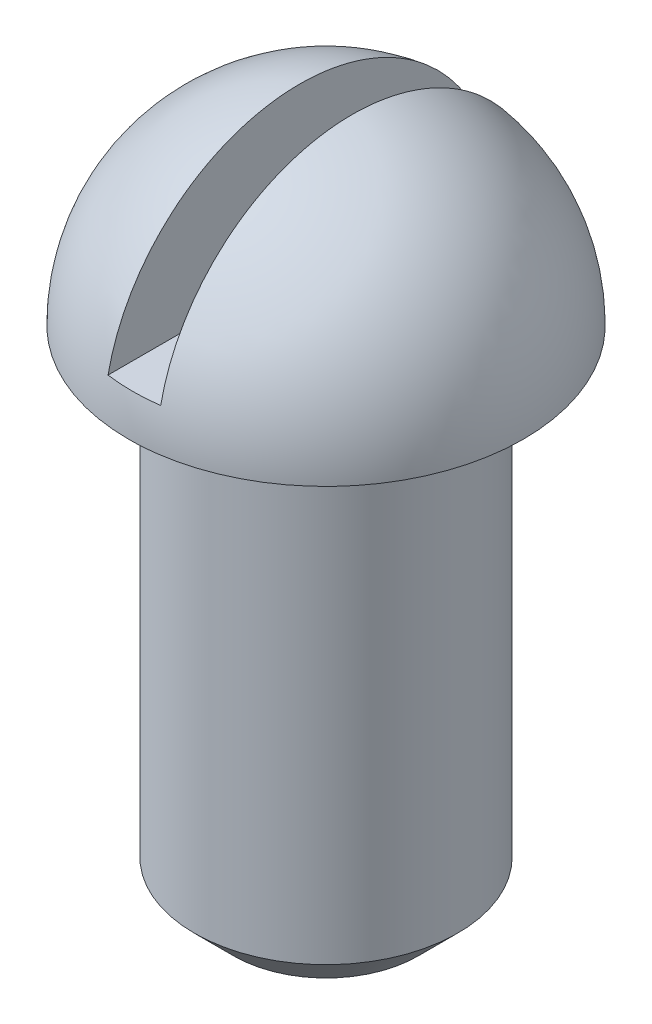
ISO-10303-21;
HEADER;
FILE_DESCRIPTION(('STEP AP214'),'2;1');
FILE_NAME('part.step','',(''),(''),'','','');
FILE_SCHEMA(('AUTOMOTIVE_DESIGN { 1 0 10303 214 1 1 1 1 }'));
ENDSEC;
DATA;
#1=APPLICATION_CONTEXT('core data for automotive mechanical design processes');
#2=APPLICATION_PROTOCOL_DEFINITION('international standard','automotive_design',2000,#1);
#3=PRODUCT_CONTEXT('',#1,'mechanical');
#4=PRODUCT('Part','Part','',(#3));
#5=PRODUCT_RELATED_PRODUCT_CATEGORY('part','',(#4));
#6=PRODUCT_DEFINITION_FORMATION('','',#4);
#7=PRODUCT_DEFINITION_CONTEXT('part definition',#1,'design');
#8=PRODUCT_DEFINITION('design','',#6,#7);
#9=PRODUCT_DEFINITION_SHAPE('','',#8);
#10=(LENGTH_UNIT() NAMED_UNIT(*) SI_UNIT(.MILLI.,.METRE.));
#11=(NAMED_UNIT(*) PLANE_ANGLE_UNIT() SI_UNIT($,.RADIAN.));
#12=(NAMED_UNIT(*) SI_UNIT($,.STERADIAN.) SOLID_ANGLE_UNIT());
#13=UNCERTAINTY_MEASURE_WITH_UNIT(LENGTH_MEASURE(1.E-05),#10,'distance_accuracy_value','');
#14=(GEOMETRIC_REPRESENTATION_CONTEXT(3) GLOBAL_UNCERTAINTY_ASSIGNED_CONTEXT((#13)) GLOBAL_UNIT_ASSIGNED_CONTEXT((#10,
#11,#12)) REPRESENTATION_CONTEXT('',''));
#15=CARTESIAN_POINT('',(0.,0.,0.));
#16=DIRECTION('',(0.,0.,1.));
#17=DIRECTION('',(1.,0.,0.));
#18=AXIS2_PLACEMENT_3D('',#15,#16,#17);
#19=CARTESIAN_POINT('',(0.,38.,0.));
#20=DIRECTION('',(0.,-1.,0.));
#21=DIRECTION('',(0.,0.,-1.));
#22=AXIS2_PLACEMENT_3D('',#19,#20,#21);
#23=CYLINDRICAL_SURFACE('',#22,10.);
#24=CARTESIAN_POINT('',(0.,3.,0.));
#25=DIRECTION('',(0.,1.,0.));
#26=DIRECTION('',(0.,0.,1.));
#27=AXIS2_PLACEMENT_3D('',#24,#25,#26);
#28=CIRCLE('',#27,10.);
#29=CARTESIAN_POINT('',(0.,3.,10.));
#30=VERTEX_POINT('',#29);
#31=EDGE_CURVE('E41',#30,#30,#28,.T.);
#32=ORIENTED_EDGE('',*,*,#31,.T.);
#33=EDGE_LOOP('',(#32));
#34=FACE_BOUND('',#33,.T.);
#35=CARTESIAN_POINT('',(0.,38.,0.));
#36=DIRECTION('',(0.,1.,0.));
#37=DIRECTION('',(0.,0.,1.));
#38=AXIS2_PLACEMENT_3D('',#35,#36,#37);
#39=CIRCLE('',#38,10.);
#40=CARTESIAN_POINT('',(0.,38.,10.));
#41=VERTEX_POINT('',#40);
#42=EDGE_CURVE('E78',#41,#41,#39,.T.);
#43=ORIENTED_EDGE('',*,*,#42,.F.);
#44=EDGE_LOOP('',(#43));
#45=FACE_BOUND('',#44,.T.);
#46=ADVANCED_FACE('F33',(#34,#45),#23,.T.);
#47=CARTESIAN_POINT('',(0.,0.,0.));
#48=DIRECTION('',(0.,1.,0.));
#49=DIRECTION('',(0.,0.,1.));
#50=AXIS2_PLACEMENT_3D('',#47,#48,#49);
#51=PLANE('',#50);
#52=CARTESIAN_POINT('',(0.,0.,0.));
#53=DIRECTION('',(0.,1.,0.));
#54=DIRECTION('',(0.,0.,1.));
#55=AXIS2_PLACEMENT_3D('',#52,#53,#54);
#56=CIRCLE('',#55,6.99999999999999);
#57=CARTESIAN_POINT('',(0.,0.,6.99999999999999));
#58=VERTEX_POINT('',#57);
#59=EDGE_CURVE('E11',#58,#58,#56,.F.);
#60=ORIENTED_EDGE('',*,*,#59,.T.);
#61=EDGE_LOOP('',(#60));
#62=FACE_BOUND('',#61,.T.);
#63=ADVANCED_FACE('F93',(#62),#51,.F.);
#64=CARTESIAN_POINT('',(0.,38.,0.));
#65=DIRECTION('',(0.,-1.,0.));
#66=DIRECTION('',(0.,0.,-1.));
#67=AXIS2_PLACEMENT_3D('',#64,#65,#66);
#68=PLANE('',#67);
#69=CARTESIAN_POINT('',(0.,38.,0.));
#70=DIRECTION('',(0.,1.,0.));
#71=DIRECTION('',(0.,0.,1.));
#72=AXIS2_PLACEMENT_3D('',#69,#70,#71);
#73=CIRCLE('',#72,15.);
#74=CARTESIAN_POINT('',(0.,38.,15.));
#75=VERTEX_POINT('',#74);
#76=EDGE_CURVE('E72',#75,#75,#73,.T.);
#77=ORIENTED_EDGE('',*,*,#76,.F.);
#78=EDGE_LOOP('',(#77));
#79=FACE_BOUND('',#78,.T.);
#80=ORIENTED_EDGE('',*,*,#42,.T.);
#81=EDGE_LOOP('',(#80));
#82=FACE_BOUND('',#81,.T.);
#83=ADVANCED_FACE('F97',(#79,#82),#68,.T.);
#84=CARTESIAN_POINT('',(0.,38.,0.));
#85=DIRECTION('',(0.,1.,0.));
#86=DIRECTION('',(1.,0.,0.));
#87=AXIS2_PLACEMENT_3D('',#84,#85,#86);
#88=SPHERICAL_SURFACE('',#87,15.);
#89=CARTESIAN_POINT('',(0.,41.,0.));
#90=DIRECTION('',(0.,-1.,0.));
#91=DIRECTION('',(0.,0.,-1.));
#92=AXIS2_PLACEMENT_3D('',#89,#90,#91);
#93=CIRCLE('',#92,14.6969384566991);
#94=CARTESIAN_POINT('',(-2.,41.,14.560219778561));
#95=VERTEX_POINT('',#94);
#96=CARTESIAN_POINT('',(1.99999999999999,41.,14.560219778561));
#97=VERTEX_POINT('',#96);
#98=EDGE_CURVE('E61',#95,#97,#93,.F.);
#99=ORIENTED_EDGE('',*,*,#98,.F.);
#100=CARTESIAN_POINT('',(-2.,38.,0.));
#101=DIRECTION('',(-1.,0.,0.));
#102=DIRECTION('',(0.,-1.,0.));
#103=AXIS2_PLACEMENT_3D('',#100,#101,#102);
#104=CIRCLE('',#103,14.8660687473185);
#105=CARTESIAN_POINT('',(-2.,41.,-14.560219778561));
#106=VERTEX_POINT('',#105);
#107=EDGE_CURVE('E55',#106,#95,#104,.F.);
#108=ORIENTED_EDGE('',*,*,#107,.F.);
#109=CARTESIAN_POINT('',(1.99999999999999,41.,-14.560219778561));
#110=VERTEX_POINT('',#109);
#111=EDGE_CURVE('E67',#110,#106,#93,.F.);
#112=ORIENTED_EDGE('',*,*,#111,.F.);
#113=CARTESIAN_POINT('',(2.,38.,0.));
#114=DIRECTION('',(1.,0.,0.));
#115=DIRECTION('',(0.,1.,0.));
#116=AXIS2_PLACEMENT_3D('',#113,#114,#115);
#117=CIRCLE('',#116,14.8660687473185);
#118=EDGE_CURVE('E70',#97,#110,#117,.F.);
#119=ORIENTED_EDGE('',*,*,#118,.F.);
#120=EDGE_LOOP('',(#99,#108,#112,#119));
#121=FACE_BOUND('',#120,.T.);
#122=ORIENTED_EDGE('',*,*,#76,.T.);
#123=EDGE_LOOP('',(#122));
#124=FACE_BOUND('',#123,.T.);
#125=ADVANCED_FACE('F74',(#121,#124),#88,.T.);
#126=CARTESIAN_POINT('',(-2.00000000000001,57.5178286445315,-15.));
#127=DIRECTION('',(-1.,0.,0.));
#128=DIRECTION('',(0.,-1.,0.));
#129=AXIS2_PLACEMENT_3D('',#126,#127,#128);
#130=PLANE('',#129);
#131=ORIENTED_EDGE('',*,*,#107,.T.);
#132=DIRECTION('',(0.,0.,1.));
#133=VECTOR('',#132,1.);
#134=CARTESIAN_POINT('',(-2.,41.,-15.));
#135=LINE('',#134,#133);
#136=EDGE_CURVE('E63',#106,#95,#135,.T.);
#137=ORIENTED_EDGE('',*,*,#136,.F.);
#138=EDGE_LOOP('',(#131,#137));
#139=FACE_BOUND('',#138,.T.);
#140=ADVANCED_FACE('F103',(#139),#130,.F.);
#141=CARTESIAN_POINT('',(1.99999999999999,57.5178286445315,-15.));
#142=DIRECTION('',(1.,0.,0.));
#143=DIRECTION('',(0.,1.,0.));
#144=AXIS2_PLACEMENT_3D('',#141,#142,#143);
#145=PLANE('',#144);
#146=ORIENTED_EDGE('',*,*,#118,.T.);
#147=DIRECTION('',(0.,0.,1.));
#148=VECTOR('',#147,1.);
#149=CARTESIAN_POINT('',(1.99999999999999,41.,-15.));
#150=LINE('',#149,#148);
#151=EDGE_CURVE('E48',#110,#97,#150,.T.);
#152=ORIENTED_EDGE('',*,*,#151,.T.);
#153=EDGE_LOOP('',(#146,#152));
#154=FACE_BOUND('',#153,.T.);
#155=ADVANCED_FACE('F69',(#154),#145,.F.);
#156=CARTESIAN_POINT('',(-2.,41.,-15.));
#157=DIRECTION('',(0.,-1.,0.));
#158=DIRECTION('',(0.,0.,-1.));
#159=AXIS2_PLACEMENT_3D('',#156,#157,#158);
#160=PLANE('',#159);
#161=ORIENTED_EDGE('',*,*,#98,.T.);
#162=ORIENTED_EDGE('',*,*,#151,.F.);
#163=ORIENTED_EDGE('',*,*,#111,.T.);
#164=ORIENTED_EDGE('',*,*,#136,.T.);
#165=EDGE_LOOP('',(#161,#162,#163,#164));
#166=FACE_BOUND('',#165,.T.);
#167=ADVANCED_FACE('F62',(#166),#160,.F.);
#168=CARTESIAN_POINT('',(0.,3.,0.));
#169=DIRECTION('',(0.,1.,0.));
#170=DIRECTION('',(0.,0.,1.));
#171=AXIS2_PLACEMENT_3D('',#168,#169,#170);
#172=CONICAL_SURFACE('',#171,10.,0.785398163397449);
#173=ORIENTED_EDGE('',*,*,#59,.F.);
#174=EDGE_LOOP('',(#173));
#175=FACE_BOUND('',#174,.T.);
#176=ORIENTED_EDGE('',*,*,#31,.F.);
#177=EDGE_LOOP('',(#176));
#178=FACE_BOUND('',#177,.T.);
#179=ADVANCED_FACE('F35',(#175,#178),#172,.T.);
#180=CLOSED_SHELL('',(#46,#63,#83,#125,#140,#155,#167,#179));
#181=MANIFOLD_SOLID_BREP('B2',#180);
#182=ADVANCED_BREP_SHAPE_REPRESENTATION('',(#18,#181),#14);
#183=SHAPE_DEFINITION_REPRESENTATION(#9,#182);
ENDSEC;
END-ISO-10303-21;
